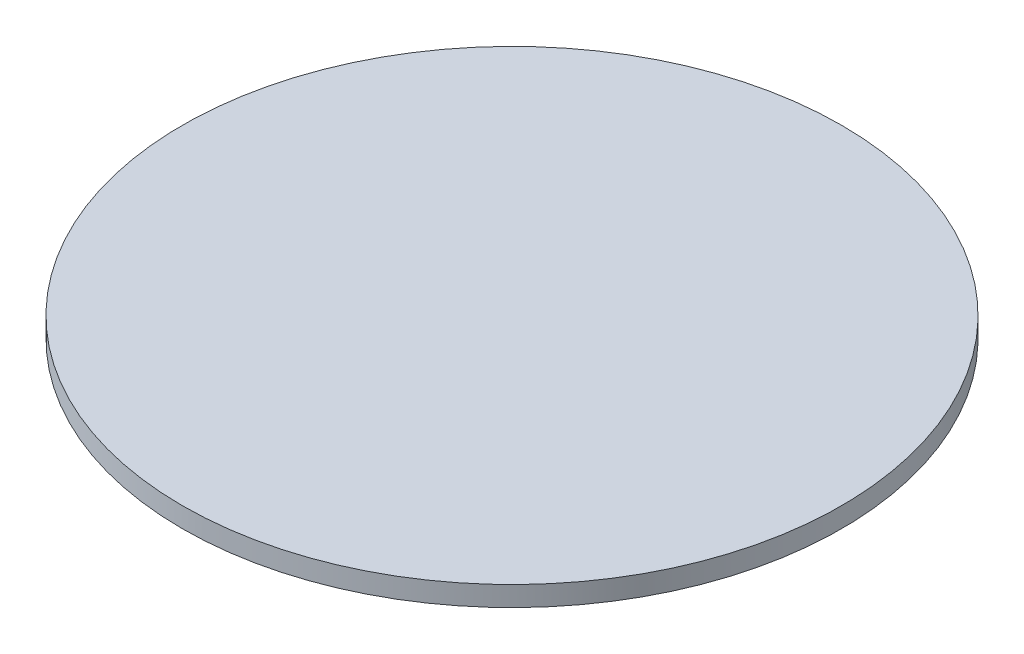
ISO-10303-21;
HEADER;
FILE_DESCRIPTION(('STEP AP214'),'2;1');
FILE_NAME('part.step','',(''),(''),'','','');
FILE_SCHEMA(('AUTOMOTIVE_DESIGN { 1 0 10303 214 1 1 1 1 }'));
ENDSEC;
DATA;
#1=APPLICATION_CONTEXT('core data for automotive mechanical design processes');
#2=APPLICATION_PROTOCOL_DEFINITION('international standard','automotive_design',2000,#1);
#3=PRODUCT_CONTEXT('',#1,'mechanical');
#4=PRODUCT('Part','Part','',(#3));
#5=PRODUCT_RELATED_PRODUCT_CATEGORY('part','',(#4));
#6=PRODUCT_DEFINITION_FORMATION('','',#4);
#7=PRODUCT_DEFINITION_CONTEXT('part definition',#1,'design');
#8=PRODUCT_DEFINITION('design','',#6,#7);
#9=PRODUCT_DEFINITION_SHAPE('','',#8);
#10=(LENGTH_UNIT() NAMED_UNIT(*) SI_UNIT(.MILLI.,.METRE.));
#11=(NAMED_UNIT(*) PLANE_ANGLE_UNIT() SI_UNIT($,.RADIAN.));
#12=(NAMED_UNIT(*) SI_UNIT($,.STERADIAN.) SOLID_ANGLE_UNIT());
#13=UNCERTAINTY_MEASURE_WITH_UNIT(LENGTH_MEASURE(1.E-05),#10,'distance_accuracy_value','');
#14=(GEOMETRIC_REPRESENTATION_CONTEXT(3) GLOBAL_UNCERTAINTY_ASSIGNED_CONTEXT((#13)) GLOBAL_UNIT_ASSIGNED_CONTEXT((#10,
#11,#12)) REPRESENTATION_CONTEXT('',''));
#15=CARTESIAN_POINT('',(0.,0.,0.));
#16=DIRECTION('',(0.,0.,1.));
#17=DIRECTION('',(1.,0.,0.));
#18=AXIS2_PLACEMENT_3D('',#15,#16,#17);
#19=CARTESIAN_POINT('',(0.,1.,0.));
#20=DIRECTION('',(0.,-1.,0.));
#21=DIRECTION('',(0.,0.,-1.));
#22=AXIS2_PLACEMENT_3D('',#19,#20,#21);
#23=CYLINDRICAL_SURFACE('',#22,16.5);
#24=CARTESIAN_POINT('',(0.,1.,0.));
#25=DIRECTION('',(0.,1.,0.));
#26=DIRECTION('',(0.,0.,1.));
#27=AXIS2_PLACEMENT_3D('',#24,#25,#26);
#28=CIRCLE('',#27,16.5);
#29=CARTESIAN_POINT('',(0.,1.,16.5));
#30=VERTEX_POINT('',#29);
#31=EDGE_CURVE('E10',#30,#30,#28,.T.);
#32=ORIENTED_EDGE('',*,*,#31,.F.);
#33=EDGE_LOOP('',(#32));
#34=FACE_BOUND('',#33,.T.);
#35=CARTESIAN_POINT('',(0.,0.,0.));
#36=DIRECTION('',(0.,1.,0.));
#37=DIRECTION('',(0.,0.,1.));
#38=AXIS2_PLACEMENT_3D('',#35,#36,#37);
#39=CIRCLE('',#38,16.5);
#40=CARTESIAN_POINT('',(0.,0.,16.5));
#41=VERTEX_POINT('',#40);
#42=EDGE_CURVE('E34',#41,#41,#39,.T.);
#43=ORIENTED_EDGE('',*,*,#42,.T.);
#44=EDGE_LOOP('',(#43));
#45=FACE_BOUND('',#44,.T.);
#46=ADVANCED_FACE('F31',(#34,#45),#23,.T.);
#47=CARTESIAN_POINT('',(0.,1.,0.));
#48=DIRECTION('',(0.,1.,0.));
#49=DIRECTION('',(0.,0.,1.));
#50=AXIS2_PLACEMENT_3D('',#47,#48,#49);
#51=PLANE('',#50);
#52=ORIENTED_EDGE('',*,*,#31,.T.);
#53=EDGE_LOOP('',(#52));
#54=FACE_BOUND('',#53,.T.);
#55=ADVANCED_FACE('F46',(#54),#51,.T.);
#56=CARTESIAN_POINT('',(0.,0.,0.));
#57=DIRECTION('',(0.,1.,0.));
#58=DIRECTION('',(0.,0.,1.));
#59=AXIS2_PLACEMENT_3D('',#56,#57,#58);
#60=PLANE('',#59);
#61=ORIENTED_EDGE('',*,*,#42,.F.);
#62=EDGE_LOOP('',(#61));
#63=FACE_BOUND('',#62,.T.);
#64=ADVANCED_FACE('F44',(#63),#60,.F.);
#65=CLOSED_SHELL('',(#46,#55,#64));
#66=MANIFOLD_SOLID_BREP('B2',#65);
#67=ADVANCED_BREP_SHAPE_REPRESENTATION('',(#18,#66),#14);
#68=SHAPE_DEFINITION_REPRESENTATION(#9,#67);
ENDSEC;
END-ISO-10303-21;
